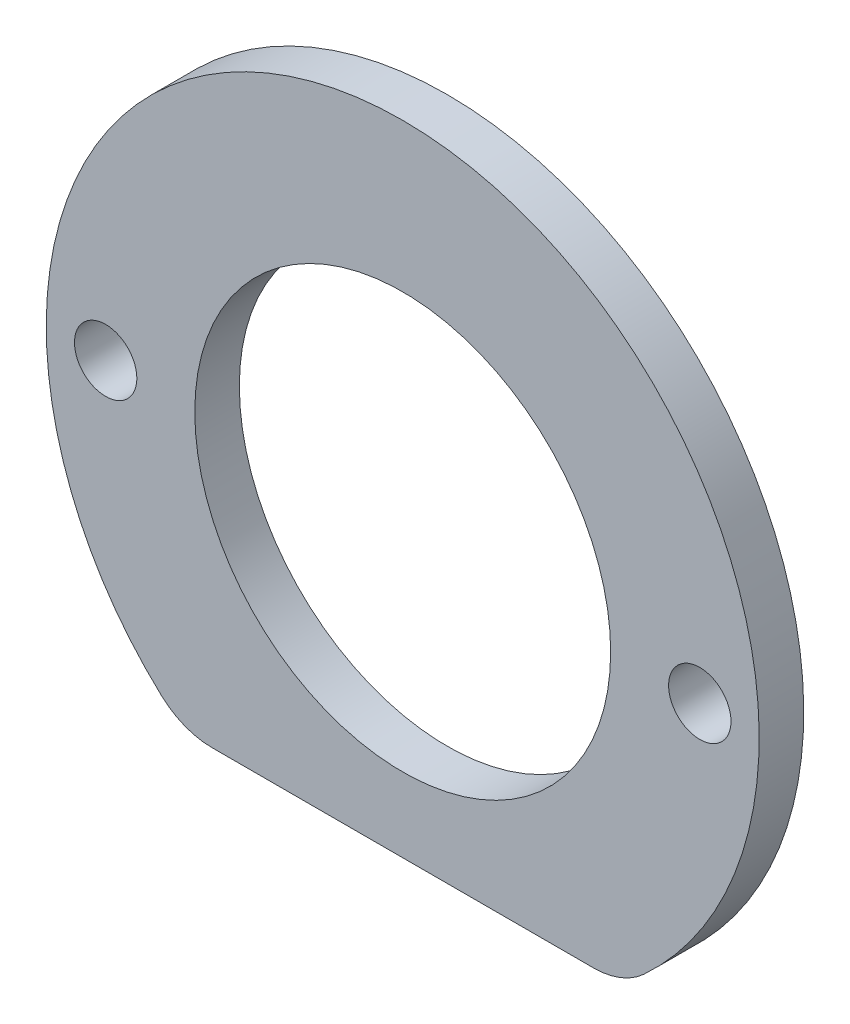
ISO-10303-21;
HEADER;
FILE_DESCRIPTION(('STEP AP214'),'2;1');
FILE_NAME('part.step','',(''),(''),'','','');
FILE_SCHEMA(('AUTOMOTIVE_DESIGN { 1 0 10303 214 1 1 1 1 }'));
ENDSEC;
DATA;
#1=APPLICATION_CONTEXT('core data for automotive mechanical design processes');
#2=APPLICATION_PROTOCOL_DEFINITION('international standard','automotive_design',2000,#1);
#3=PRODUCT_CONTEXT('',#1,'mechanical');
#4=PRODUCT('Part','Part','',(#3));
#5=PRODUCT_RELATED_PRODUCT_CATEGORY('part','',(#4));
#6=PRODUCT_DEFINITION_FORMATION('','',#4);
#7=PRODUCT_DEFINITION_CONTEXT('part definition',#1,'design');
#8=PRODUCT_DEFINITION('design','',#6,#7);
#9=PRODUCT_DEFINITION_SHAPE('','',#8);
#10=(LENGTH_UNIT() NAMED_UNIT(*) SI_UNIT(.MILLI.,.METRE.));
#11=(NAMED_UNIT(*) PLANE_ANGLE_UNIT() SI_UNIT($,.RADIAN.));
#12=(NAMED_UNIT(*) SI_UNIT($,.STERADIAN.) SOLID_ANGLE_UNIT());
#13=UNCERTAINTY_MEASURE_WITH_UNIT(LENGTH_MEASURE(1.E-05),#10,'distance_accuracy_value','');
#14=(GEOMETRIC_REPRESENTATION_CONTEXT(3) GLOBAL_UNCERTAINTY_ASSIGNED_CONTEXT((#13)) GLOBAL_UNIT_ASSIGNED_CONTEXT((#10,
#11,#12)) REPRESENTATION_CONTEXT('',''));
#15=CARTESIAN_POINT('',(0.,0.,0.));
#16=DIRECTION('',(0.,0.,1.));
#17=DIRECTION('',(1.,0.,0.));
#18=AXIS2_PLACEMENT_3D('',#15,#16,#17);
#19=CARTESIAN_POINT('',(0.,-19.,3.));
#20=DIRECTION('',(0.,-1.,0.));
#21=DIRECTION('',(1.,0.,0.));
#22=AXIS2_PLACEMENT_3D('',#19,#20,#21);
#23=PLANE('',#22);
#24=DIRECTION('',(-1.,0.,0.));
#25=VECTOR('',#24,1.);
#26=CARTESIAN_POINT('',(0.,-19.,3.));
#27=LINE('',#26,#25);
#28=CARTESIAN_POINT('',(12.8452325786651,-19.,3.));
#29=VERTEX_POINT('',#28);
#30=CARTESIAN_POINT('',(-12.8452325786651,-19.,3.));
#31=VERTEX_POINT('',#30);
#32=EDGE_CURVE('E98',#29,#31,#27,.T.);
#33=ORIENTED_EDGE('',*,*,#32,.T.);
#34=DIRECTION('',(0.,0.,1.));
#35=VECTOR('',#34,1.);
#36=CARTESIAN_POINT('',(-12.8452325786651,-19.,0.));
#37=LINE('',#36,#35);
#38=CARTESIAN_POINT('',(-12.8452325786651,-19.,0.));
#39=VERTEX_POINT('',#38);
#40=EDGE_CURVE('E86',#31,#39,#37,.F.);
#41=ORIENTED_EDGE('',*,*,#40,.T.);
#42=DIRECTION('',(-1.,0.,0.));
#43=VECTOR('',#42,1.);
#44=CARTESIAN_POINT('',(0.,-19.,0.));
#45=LINE('',#44,#43);
#46=CARTESIAN_POINT('',(12.8452325786651,-19.,0.));
#47=VERTEX_POINT('',#46);
#48=EDGE_CURVE('E79',#47,#39,#45,.T.);
#49=ORIENTED_EDGE('',*,*,#48,.F.);
#50=DIRECTION('',(0.,0.,1.));
#51=VECTOR('',#50,1.);
#52=CARTESIAN_POINT('',(12.8452325786651,-19.,3.));
#53=LINE('',#52,#51);
#54=EDGE_CURVE('E91',#47,#29,#53,.T.);
#55=ORIENTED_EDGE('',*,*,#54,.T.);
#56=EDGE_LOOP('',(#33,#41,#49,#55));
#57=FACE_BOUND('',#56,.T.);
#58=ADVANCED_FACE('F35',(#57),#23,.T.);
#59=CARTESIAN_POINT('',(0.,0.,3.));
#60=DIRECTION('',(0.,0.,-1.));
#61=DIRECTION('',(-1.,0.,0.));
#62=AXIS2_PLACEMENT_3D('',#59,#60,#61);
#63=CYLINDRICAL_SURFACE('',#62,14.);
#64=CARTESIAN_POINT('',(0.,0.,3.));
#65=DIRECTION('',(0.,0.,1.));
#66=DIRECTION('',(1.,0.,0.));
#67=AXIS2_PLACEMENT_3D('',#64,#65,#66);
#68=CIRCLE('',#67,14.);
#69=CARTESIAN_POINT('',(14.,0.,3.));
#70=VERTEX_POINT('',#69);
#71=EDGE_CURVE('E155',#70,#70,#68,.T.);
#72=ORIENTED_EDGE('',*,*,#71,.T.);
#73=EDGE_LOOP('',(#72));
#74=FACE_BOUND('',#73,.T.);
#75=CARTESIAN_POINT('',(0.,0.,0.));
#76=DIRECTION('',(0.,0.,1.));
#77=DIRECTION('',(1.,0.,0.));
#78=AXIS2_PLACEMENT_3D('',#75,#76,#77);
#79=CIRCLE('',#78,14.);
#80=CARTESIAN_POINT('',(14.,0.,0.));
#81=VERTEX_POINT('',#80);
#82=EDGE_CURVE('E93',#81,#81,#79,.T.);
#83=ORIENTED_EDGE('',*,*,#82,.F.);
#84=EDGE_LOOP('',(#83));
#85=FACE_BOUND('',#84,.T.);
#86=ADVANCED_FACE('F119',(#74,#85),#63,.F.);
#87=CARTESIAN_POINT('',(-20.,0.,3.));
#88=DIRECTION('',(0.,0.,-1.));
#89=DIRECTION('',(-1.,0.,0.));
#90=AXIS2_PLACEMENT_3D('',#87,#88,#89);
#91=CYLINDRICAL_SURFACE('',#90,2.1);
#92=CARTESIAN_POINT('',(-20.,0.,3.));
#93=DIRECTION('',(0.,0.,1.));
#94=DIRECTION('',(1.,0.,0.));
#95=AXIS2_PLACEMENT_3D('',#92,#93,#94);
#96=CIRCLE('',#95,2.1);
#97=CARTESIAN_POINT('',(-17.9,0.,3.));
#98=VERTEX_POINT('',#97);
#99=EDGE_CURVE('E158',#98,#98,#96,.T.);
#100=ORIENTED_EDGE('',*,*,#99,.T.);
#101=EDGE_LOOP('',(#100));
#102=FACE_BOUND('',#101,.T.);
#103=CARTESIAN_POINT('',(-20.,0.,0.));
#104=DIRECTION('',(0.,0.,1.));
#105=DIRECTION('',(1.,0.,0.));
#106=AXIS2_PLACEMENT_3D('',#103,#104,#105);
#107=CIRCLE('',#106,2.1);
#108=CARTESIAN_POINT('',(-17.9,0.,0.));
#109=VERTEX_POINT('',#108);
#110=EDGE_CURVE('E144',#109,#109,#107,.T.);
#111=ORIENTED_EDGE('',*,*,#110,.F.);
#112=EDGE_LOOP('',(#111));
#113=FACE_BOUND('',#112,.T.);
#114=ADVANCED_FACE('F124',(#102,#113),#91,.F.);
#115=CARTESIAN_POINT('',(20.,0.,3.));
#116=DIRECTION('',(0.,0.,-1.));
#117=DIRECTION('',(-1.,0.,0.));
#118=AXIS2_PLACEMENT_3D('',#115,#116,#117);
#119=CYLINDRICAL_SURFACE('',#118,2.1);
#120=CARTESIAN_POINT('',(20.,0.,3.));
#121=DIRECTION('',(0.,0.,1.));
#122=DIRECTION('',(1.,0.,0.));
#123=AXIS2_PLACEMENT_3D('',#120,#121,#122);
#124=CIRCLE('',#123,2.1);
#125=CARTESIAN_POINT('',(22.1,0.,3.));
#126=VERTEX_POINT('',#125);
#127=EDGE_CURVE('E140',#126,#126,#124,.T.);
#128=ORIENTED_EDGE('',*,*,#127,.T.);
#129=EDGE_LOOP('',(#128));
#130=FACE_BOUND('',#129,.T.);
#131=CARTESIAN_POINT('',(20.,0.,0.));
#132=DIRECTION('',(0.,0.,1.));
#133=DIRECTION('',(1.,0.,0.));
#134=AXIS2_PLACEMENT_3D('',#131,#132,#133);
#135=CIRCLE('',#134,2.1);
#136=CARTESIAN_POINT('',(22.1,0.,0.));
#137=VERTEX_POINT('',#136);
#138=EDGE_CURVE('E143',#137,#137,#135,.T.);
#139=ORIENTED_EDGE('',*,*,#138,.F.);
#140=EDGE_LOOP('',(#139));
#141=FACE_BOUND('',#140,.T.);
#142=ADVANCED_FACE('F130',(#130,#141),#119,.F.);
#143=CARTESIAN_POINT('',(0.,0.,3.));
#144=DIRECTION('',(0.,0.,-1.));
#145=DIRECTION('',(-1.,0.,0.));
#146=AXIS2_PLACEMENT_3D('',#143,#144,#145);
#147=CYLINDRICAL_SURFACE('',#146,24.);
#148=CARTESIAN_POINT('',(0.,0.,0.));
#149=DIRECTION('',(0.,0.,1.));
#150=DIRECTION('',(1.,0.,0.));
#151=AXIS2_PLACEMENT_3D('',#148,#149,#150);
#152=CIRCLE('',#151,24.);
#153=CARTESIAN_POINT('',(16.2255569414718,-17.6842105263158,0.));
#154=VERTEX_POINT('',#153);
#155=CARTESIAN_POINT('',(-16.2255569414718,-17.6842105263158,0.));
#156=VERTEX_POINT('',#155);
#157=EDGE_CURVE('E80',#154,#156,#152,.T.);
#158=ORIENTED_EDGE('',*,*,#157,.T.);
#159=DIRECTION('',(0.,0.,-1.));
#160=VECTOR('',#159,1.);
#161=CARTESIAN_POINT('',(-16.2255569414718,-17.6842105263158,3.));
#162=LINE('',#161,#160);
#163=CARTESIAN_POINT('',(-16.2255569414718,-17.6842105263158,3.));
#164=VERTEX_POINT('',#163);
#165=EDGE_CURVE('E50',#156,#164,#162,.F.);
#166=ORIENTED_EDGE('',*,*,#165,.T.);
#167=CARTESIAN_POINT('',(0.,0.,3.));
#168=DIRECTION('',(0.,0.,1.));
#169=DIRECTION('',(1.,0.,0.));
#170=AXIS2_PLACEMENT_3D('',#167,#168,#169);
#171=CIRCLE('',#170,24.);
#172=CARTESIAN_POINT('',(16.2255569414718,-17.6842105263158,3.));
#173=VERTEX_POINT('',#172);
#174=EDGE_CURVE('E95',#173,#164,#171,.T.);
#175=ORIENTED_EDGE('',*,*,#174,.F.);
#176=DIRECTION('',(0.,0.,-1.));
#177=VECTOR('',#176,1.);
#178=CARTESIAN_POINT('',(16.2255569414718,-17.6842105263158,3.));
#179=LINE('',#178,#177);
#180=EDGE_CURVE('E103',#173,#154,#179,.T.);
#181=ORIENTED_EDGE('',*,*,#180,.T.);
#182=EDGE_LOOP('',(#158,#166,#175,#181));
#183=FACE_BOUND('',#182,.T.);
#184=ADVANCED_FACE('F105',(#183),#147,.T.);
#185=CARTESIAN_POINT('',(0.,0.,3.));
#186=DIRECTION('',(0.,0.,1.));
#187=DIRECTION('',(1.,0.,0.));
#188=AXIS2_PLACEMENT_3D('',#185,#186,#187);
#189=PLANE('',#188);
#190=ORIENTED_EDGE('',*,*,#127,.F.);
#191=EDGE_LOOP('',(#190));
#192=FACE_BOUND('',#191,.T.);
#193=ORIENTED_EDGE('',*,*,#99,.F.);
#194=EDGE_LOOP('',(#193));
#195=FACE_BOUND('',#194,.T.);
#196=ORIENTED_EDGE('',*,*,#71,.F.);
#197=EDGE_LOOP('',(#196));
#198=FACE_BOUND('',#197,.T.);
#199=ORIENTED_EDGE('',*,*,#174,.T.);
#200=CARTESIAN_POINT('',(-12.8452325786651,-14.,3.));
#201=DIRECTION('',(0.,0.,1.));
#202=DIRECTION('',(1.,0.,0.));
#203=AXIS2_PLACEMENT_3D('',#200,#201,#202);
#204=CIRCLE('',#203,5.);
#205=EDGE_CURVE('E11',#164,#31,#204,.T.);
#206=ORIENTED_EDGE('',*,*,#205,.T.);
#207=ORIENTED_EDGE('',*,*,#32,.F.);
#208=CARTESIAN_POINT('',(12.8452325786651,-14.,3.));
#209=DIRECTION('',(0.,0.,1.));
#210=DIRECTION('',(1.,0.,0.));
#211=AXIS2_PLACEMENT_3D('',#208,#209,#210);
#212=CIRCLE('',#211,5.);
#213=EDGE_CURVE('E43',#29,#173,#212,.T.);
#214=ORIENTED_EDGE('',*,*,#213,.T.);
#215=EDGE_LOOP('',(#199,#206,#207,#214));
#216=FACE_BOUND('',#215,.T.);
#217=ADVANCED_FACE('F107',(#192,#195,#198,#216),#189,.T.);
#218=CARTESIAN_POINT('',(0.,0.,0.));
#219=DIRECTION('',(0.,0.,1.));
#220=DIRECTION('',(1.,0.,0.));
#221=AXIS2_PLACEMENT_3D('',#218,#219,#220);
#222=PLANE('',#221);
#223=ORIENTED_EDGE('',*,*,#138,.T.);
#224=EDGE_LOOP('',(#223));
#225=FACE_BOUND('',#224,.T.);
#226=ORIENTED_EDGE('',*,*,#110,.T.);
#227=EDGE_LOOP('',(#226));
#228=FACE_BOUND('',#227,.T.);
#229=ORIENTED_EDGE('',*,*,#82,.T.);
#230=EDGE_LOOP('',(#229));
#231=FACE_BOUND('',#230,.T.);
#232=ORIENTED_EDGE('',*,*,#48,.T.);
#233=CARTESIAN_POINT('',(-12.8452325786651,-14.,0.));
#234=DIRECTION('',(0.,0.,1.));
#235=DIRECTION('',(1.,0.,0.));
#236=AXIS2_PLACEMENT_3D('',#233,#234,#235);
#237=CIRCLE('',#236,5.);
#238=EDGE_CURVE('E85',#39,#156,#237,.F.);
#239=ORIENTED_EDGE('',*,*,#238,.T.);
#240=ORIENTED_EDGE('',*,*,#157,.F.);
#241=CARTESIAN_POINT('',(12.8452325786651,-14.,0.));
#242=DIRECTION('',(0.,0.,1.));
#243=DIRECTION('',(1.,0.,0.));
#244=AXIS2_PLACEMENT_3D('',#241,#242,#243);
#245=CIRCLE('',#244,5.);
#246=EDGE_CURVE('E76',#154,#47,#245,.F.);
#247=ORIENTED_EDGE('',*,*,#246,.T.);
#248=EDGE_LOOP('',(#232,#239,#240,#247));
#249=FACE_BOUND('',#248,.T.);
#250=ADVANCED_FACE('F78',(#225,#228,#231,#249),#222,.F.);
#251=CARTESIAN_POINT('',(-12.8452325786651,-14.,3.));
#252=DIRECTION('',(0.,0.,-1.));
#253=DIRECTION('',(-1.,0.,0.));
#254=AXIS2_PLACEMENT_3D('',#251,#252,#253);
#255=CYLINDRICAL_SURFACE('',#254,5.);
#256=ORIENTED_EDGE('',*,*,#205,.F.);
#257=ORIENTED_EDGE('',*,*,#165,.F.);
#258=ORIENTED_EDGE('',*,*,#238,.F.);
#259=ORIENTED_EDGE('',*,*,#40,.F.);
#260=EDGE_LOOP('',(#256,#257,#258,#259));
#261=FACE_BOUND('',#260,.T.);
#262=ADVANCED_FACE('F109',(#261),#255,.T.);
#263=CARTESIAN_POINT('',(12.8452325786651,-14.,3.));
#264=DIRECTION('',(0.,0.,-1.));
#265=DIRECTION('',(-1.,0.,0.));
#266=AXIS2_PLACEMENT_3D('',#263,#264,#265);
#267=CYLINDRICAL_SURFACE('',#266,5.);
#268=ORIENTED_EDGE('',*,*,#213,.F.);
#269=ORIENTED_EDGE('',*,*,#54,.F.);
#270=ORIENTED_EDGE('',*,*,#246,.F.);
#271=ORIENTED_EDGE('',*,*,#180,.F.);
#272=EDGE_LOOP('',(#268,#269,#270,#271));
#273=FACE_BOUND('',#272,.T.);
#274=ADVANCED_FACE('F37',(#273),#267,.T.);
#275=CLOSED_SHELL('',(#58,#86,#114,#142,#184,#217,#250,#262,#274));
#276=MANIFOLD_SOLID_BREP('B2',#275);
#277=ADVANCED_BREP_SHAPE_REPRESENTATION('',(#18,#276),#14);
#278=SHAPE_DEFINITION_REPRESENTATION(#9,#277);
ENDSEC;
END-ISO-10303-21;
